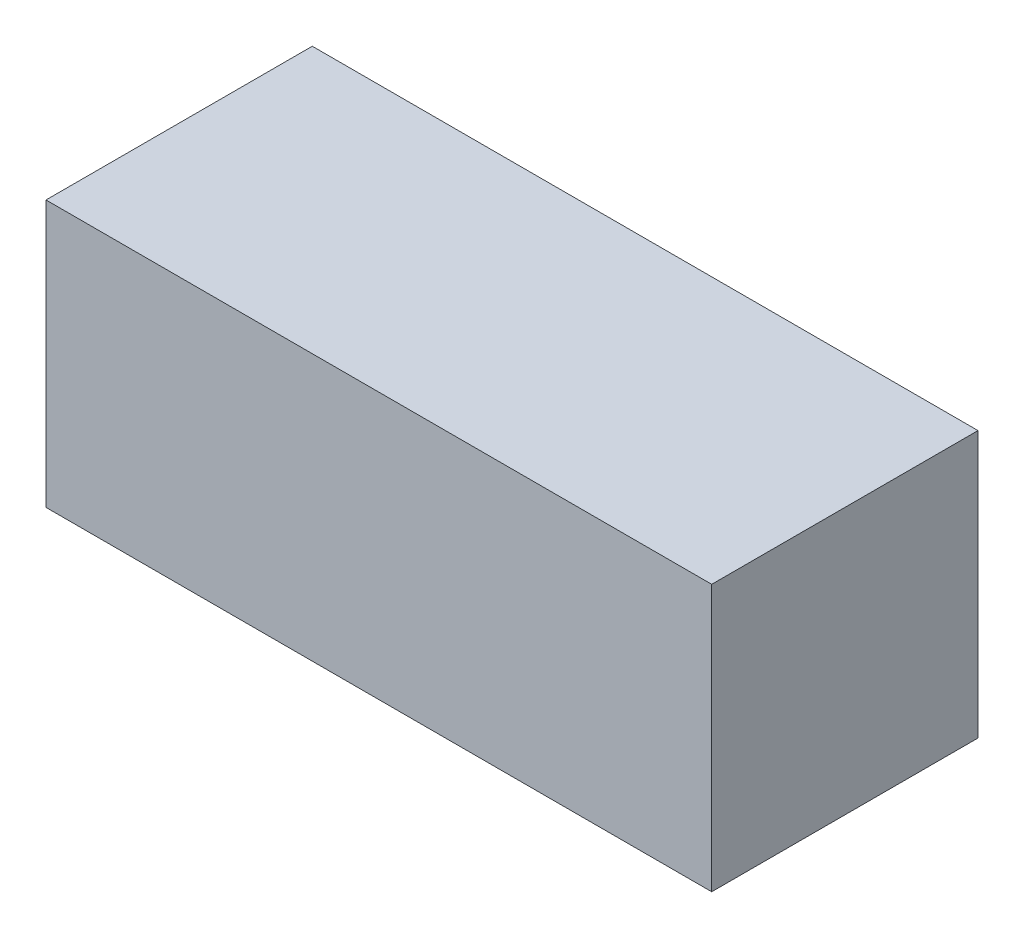
ISO-10303-21;
HEADER;
FILE_DESCRIPTION(('STEP AP214'),'2;1');
FILE_NAME('part.step','',(''),(''),'','','');
FILE_SCHEMA(('AUTOMOTIVE_DESIGN { 1 0 10303 214 1 1 1 1 }'));
ENDSEC;
DATA;
#1=APPLICATION_CONTEXT('core data for automotive mechanical design processes');
#2=APPLICATION_PROTOCOL_DEFINITION('international standard','automotive_design',2000,#1);
#3=PRODUCT_CONTEXT('',#1,'mechanical');
#4=PRODUCT('Part','Part','',(#3));
#5=PRODUCT_RELATED_PRODUCT_CATEGORY('part','',(#4));
#6=PRODUCT_DEFINITION_FORMATION('','',#4);
#7=PRODUCT_DEFINITION_CONTEXT('part definition',#1,'design');
#8=PRODUCT_DEFINITION('design','',#6,#7);
#9=PRODUCT_DEFINITION_SHAPE('','',#8);
#10=(LENGTH_UNIT() NAMED_UNIT(*) SI_UNIT(.MILLI.,.METRE.));
#11=(NAMED_UNIT(*) PLANE_ANGLE_UNIT() SI_UNIT($,.RADIAN.));
#12=(NAMED_UNIT(*) SI_UNIT($,.STERADIAN.) SOLID_ANGLE_UNIT());
#13=UNCERTAINTY_MEASURE_WITH_UNIT(LENGTH_MEASURE(1.E-05),#10,'distance_accuracy_value','');
#14=(GEOMETRIC_REPRESENTATION_CONTEXT(3) GLOBAL_UNCERTAINTY_ASSIGNED_CONTEXT((#13)) GLOBAL_UNIT_ASSIGNED_CONTEXT((#10,
#11,#12)) REPRESENTATION_CONTEXT('',''));
#15=CARTESIAN_POINT('',(0.,0.,0.));
#16=DIRECTION('',(0.,0.,1.));
#17=DIRECTION('',(1.,0.,0.));
#18=AXIS2_PLACEMENT_3D('',#15,#16,#17);
#19=CARTESIAN_POINT('',(254.,-50.8,50.8));
#20=DIRECTION('',(0.,0.,1.));
#21=DIRECTION('',(1.,0.,0.));
#22=AXIS2_PLACEMENT_3D('',#19,#20,#21);
#23=PLANE('',#22);
#24=DIRECTION('',(0.,1.,0.));
#25=VECTOR('',#24,1.);
#26=CARTESIAN_POINT('',(0.,-50.8,50.8));
#27=LINE('',#26,#25);
#28=CARTESIAN_POINT('',(0.,-50.8,50.8));
#29=VERTEX_POINT('',#28);
#30=CARTESIAN_POINT('',(0.,50.8,50.8));
#31=VERTEX_POINT('',#30);
#32=EDGE_CURVE('E102',#29,#31,#27,.T.);
#33=ORIENTED_EDGE('',*,*,#32,.F.);
#34=DIRECTION('',(-1.,0.,0.));
#35=VECTOR('',#34,1.);
#36=CARTESIAN_POINT('',(254.,-50.8,50.8));
#37=LINE('',#36,#35);
#38=CARTESIAN_POINT('',(254.,-50.8,50.8));
#39=VERTEX_POINT('',#38);
#40=EDGE_CURVE('E11',#39,#29,#37,.T.);
#41=ORIENTED_EDGE('',*,*,#40,.F.);
#42=DIRECTION('',(0.,1.,0.));
#43=VECTOR('',#42,1.);
#44=CARTESIAN_POINT('',(254.,-50.8,50.8));
#45=LINE('',#44,#43);
#46=CARTESIAN_POINT('',(254.,50.8,50.8));
#47=VERTEX_POINT('',#46);
#48=EDGE_CURVE('E97',#39,#47,#45,.T.);
#49=ORIENTED_EDGE('',*,*,#48,.T.);
#50=DIRECTION('',(-1.,0.,0.));
#51=VECTOR('',#50,1.);
#52=CARTESIAN_POINT('',(254.,50.8,50.8));
#53=LINE('',#52,#51);
#54=EDGE_CURVE('E40',#47,#31,#53,.T.);
#55=ORIENTED_EDGE('',*,*,#54,.T.);
#56=EDGE_LOOP('',(#33,#41,#49,#55));
#57=FACE_BOUND('',#56,.T.);
#58=ADVANCED_FACE('F37',(#57),#23,.T.);
#59=CARTESIAN_POINT('',(254.,-50.8,50.8));
#60=DIRECTION('',(0.,1.,0.));
#61=DIRECTION('',(0.,0.,1.));
#62=AXIS2_PLACEMENT_3D('',#59,#60,#61);
#63=PLANE('',#62);
#64=DIRECTION('',(0.,0.,-1.));
#65=VECTOR('',#64,1.);
#66=CARTESIAN_POINT('',(0.,-50.8,50.8));
#67=LINE('',#66,#65);
#68=CARTESIAN_POINT('',(0.,-50.8,-50.8));
#69=VERTEX_POINT('',#68);
#70=EDGE_CURVE('E70',#29,#69,#67,.T.);
#71=ORIENTED_EDGE('',*,*,#70,.T.);
#72=DIRECTION('',(-1.,0.,0.));
#73=VECTOR('',#72,1.);
#74=CARTESIAN_POINT('',(254.,-50.8,-50.8));
#75=LINE('',#74,#73);
#76=CARTESIAN_POINT('',(254.,-50.8,-50.8));
#77=VERTEX_POINT('',#76);
#78=EDGE_CURVE('E46',#77,#69,#75,.T.);
#79=ORIENTED_EDGE('',*,*,#78,.F.);
#80=DIRECTION('',(0.,0.,-1.));
#81=VECTOR('',#80,1.);
#82=CARTESIAN_POINT('',(254.,-50.8,50.8));
#83=LINE('',#82,#81);
#84=EDGE_CURVE('E87',#39,#77,#83,.T.);
#85=ORIENTED_EDGE('',*,*,#84,.F.);
#86=ORIENTED_EDGE('',*,*,#40,.T.);
#87=EDGE_LOOP('',(#71,#79,#85,#86));
#88=FACE_BOUND('',#87,.T.);
#89=ADVANCED_FACE('F112',(#88),#63,.F.);
#90=CARTESIAN_POINT('',(254.,-50.8,-50.8));
#91=DIRECTION('',(0.,0.,1.));
#92=DIRECTION('',(1.,0.,0.));
#93=AXIS2_PLACEMENT_3D('',#90,#91,#92);
#94=PLANE('',#93);
#95=DIRECTION('',(0.,1.,0.));
#96=VECTOR('',#95,1.);
#97=CARTESIAN_POINT('',(0.,-50.8,-50.8));
#98=LINE('',#97,#96);
#99=CARTESIAN_POINT('',(0.,50.8,-50.8));
#100=VERTEX_POINT('',#99);
#101=EDGE_CURVE('E94',#69,#100,#98,.T.);
#102=ORIENTED_EDGE('',*,*,#101,.T.);
#103=DIRECTION('',(-1.,0.,0.));
#104=VECTOR('',#103,1.);
#105=CARTESIAN_POINT('',(254.,50.8,-50.8));
#106=LINE('',#105,#104);
#107=CARTESIAN_POINT('',(254.,50.8,-50.8));
#108=VERTEX_POINT('',#107);
#109=EDGE_CURVE('E91',#108,#100,#106,.T.);
#110=ORIENTED_EDGE('',*,*,#109,.F.);
#111=DIRECTION('',(0.,1.,0.));
#112=VECTOR('',#111,1.);
#113=CARTESIAN_POINT('',(254.,-50.8,-50.8));
#114=LINE('',#113,#112);
#115=EDGE_CURVE('E82',#77,#108,#114,.T.);
#116=ORIENTED_EDGE('',*,*,#115,.F.);
#117=ORIENTED_EDGE('',*,*,#78,.T.);
#118=EDGE_LOOP('',(#102,#110,#116,#117));
#119=FACE_BOUND('',#118,.T.);
#120=ADVANCED_FACE('F92',(#119),#94,.F.);
#121=CARTESIAN_POINT('',(254.,50.8,50.8));
#122=DIRECTION('',(0.,1.,0.));
#123=DIRECTION('',(0.,0.,1.));
#124=AXIS2_PLACEMENT_3D('',#121,#122,#123);
#125=PLANE('',#124);
#126=DIRECTION('',(0.,0.,-1.));
#127=VECTOR('',#126,1.);
#128=CARTESIAN_POINT('',(0.,50.8,50.8));
#129=LINE('',#128,#127);
#130=EDGE_CURVE('E105',#31,#100,#129,.T.);
#131=ORIENTED_EDGE('',*,*,#130,.F.);
#132=ORIENTED_EDGE('',*,*,#54,.F.);
#133=DIRECTION('',(0.,0.,-1.));
#134=VECTOR('',#133,1.);
#135=CARTESIAN_POINT('',(254.,50.8,50.8));
#136=LINE('',#135,#134);
#137=EDGE_CURVE('E86',#47,#108,#136,.T.);
#138=ORIENTED_EDGE('',*,*,#137,.T.);
#139=ORIENTED_EDGE('',*,*,#109,.T.);
#140=EDGE_LOOP('',(#131,#132,#138,#139));
#141=FACE_BOUND('',#140,.T.);
#142=ADVANCED_FACE('F96',(#141),#125,.T.);
#143=CARTESIAN_POINT('',(254.,0.,0.));
#144=DIRECTION('',(-1.,0.,0.));
#145=DIRECTION('',(0.,0.,1.));
#146=AXIS2_PLACEMENT_3D('',#143,#144,#145);
#147=PLANE('',#146);
#148=ORIENTED_EDGE('',*,*,#48,.F.);
#149=ORIENTED_EDGE('',*,*,#84,.T.);
#150=ORIENTED_EDGE('',*,*,#115,.T.);
#151=ORIENTED_EDGE('',*,*,#137,.F.);
#152=EDGE_LOOP('',(#148,#149,#150,#151));
#153=FACE_BOUND('',#152,.T.);
#154=ADVANCED_FACE('F85',(#153),#147,.F.);
#155=CARTESIAN_POINT('',(0.,0.,0.));
#156=DIRECTION('',(-1.,0.,0.));
#157=DIRECTION('',(0.,0.,1.));
#158=AXIS2_PLACEMENT_3D('',#155,#156,#157);
#159=PLANE('',#158);
#160=ORIENTED_EDGE('',*,*,#32,.T.);
#161=ORIENTED_EDGE('',*,*,#130,.T.);
#162=ORIENTED_EDGE('',*,*,#101,.F.);
#163=ORIENTED_EDGE('',*,*,#70,.F.);
#164=EDGE_LOOP('',(#160,#161,#162,#163));
#165=FACE_BOUND('',#164,.T.);
#166=ADVANCED_FACE('F110',(#165),#159,.T.);
#167=CLOSED_SHELL('',(#58,#89,#120,#142,#154,#166));
#168=MANIFOLD_SOLID_BREP('B2',#167);
#169=ADVANCED_BREP_SHAPE_REPRESENTATION('',(#18,#168),#14);
#170=SHAPE_DEFINITION_REPRESENTATION(#9,#169);
ENDSEC;
END-ISO-10303-21;
